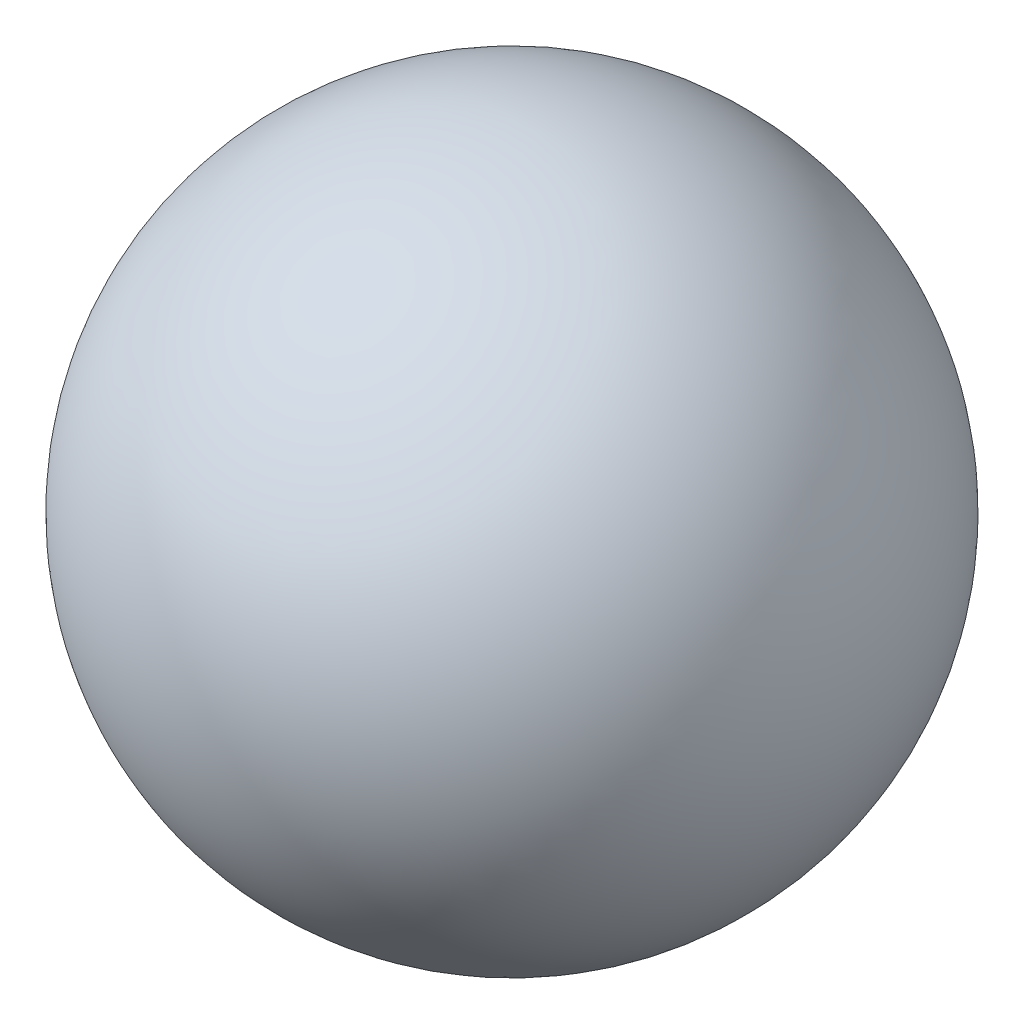
ISO-10303-21;
HEADER;
FILE_DESCRIPTION(('STEP AP214'),'2;1');
FILE_NAME('part.step','',(''),(''),'','','');
FILE_SCHEMA(('AUTOMOTIVE_DESIGN { 1 0 10303 214 1 1 1 1 }'));
ENDSEC;
DATA;
#1=APPLICATION_CONTEXT('core data for automotive mechanical design processes');
#2=APPLICATION_PROTOCOL_DEFINITION('international standard','automotive_design',2000,#1);
#3=PRODUCT_CONTEXT('',#1,'mechanical');
#4=PRODUCT('Part','Part','',(#3));
#5=PRODUCT_RELATED_PRODUCT_CATEGORY('part','',(#4));
#6=PRODUCT_DEFINITION_FORMATION('','',#4);
#7=PRODUCT_DEFINITION_CONTEXT('part definition',#1,'design');
#8=PRODUCT_DEFINITION('design','',#6,#7);
#9=PRODUCT_DEFINITION_SHAPE('','',#8);
#10=(LENGTH_UNIT() NAMED_UNIT(*) SI_UNIT(.MILLI.,.METRE.));
#11=(NAMED_UNIT(*) PLANE_ANGLE_UNIT() SI_UNIT($,.RADIAN.));
#12=(NAMED_UNIT(*) SI_UNIT($,.STERADIAN.) SOLID_ANGLE_UNIT());
#13=UNCERTAINTY_MEASURE_WITH_UNIT(LENGTH_MEASURE(1.E-05),#10,'distance_accuracy_value','');
#14=(GEOMETRIC_REPRESENTATION_CONTEXT(3) GLOBAL_UNCERTAINTY_ASSIGNED_CONTEXT((#13)) GLOBAL_UNIT_ASSIGNED_CONTEXT((#10,
#11,#12)) REPRESENTATION_CONTEXT('',''));
#15=CARTESIAN_POINT('',(0.,0.,0.));
#16=DIRECTION('',(0.,0.,1.));
#17=DIRECTION('',(1.,0.,0.));
#18=AXIS2_PLACEMENT_3D('',#15,#16,#17);
#19=CARTESIAN_POINT('',(0.,0.,0.));
#20=DIRECTION('',(0.,0.,-1.));
#21=DIRECTION('',(1.,0.,0.));
#22=AXIS2_PLACEMENT_3D('',#19,#20,#21);
#23=SPHERICAL_SURFACE('',#22,183.8);
#24=CARTESIAN_POINT('',(0.,0.,-183.8));
#25=VERTEX_POINT('',#24);
#26=VERTEX_LOOP('',#25);
#27=FACE_BOUND('',#26,.T.);
#28=ADVANCED_FACE('F29',(#27),#23,.T.);
#29=CLOSED_SHELL('',(#28));
#30=MANIFOLD_SOLID_BREP('B2',#29);
#31=ADVANCED_BREP_SHAPE_REPRESENTATION('',(#18,#30),#14);
#32=SHAPE_DEFINITION_REPRESENTATION(#9,#31);
ENDSEC;
END-ISO-10303-21;
